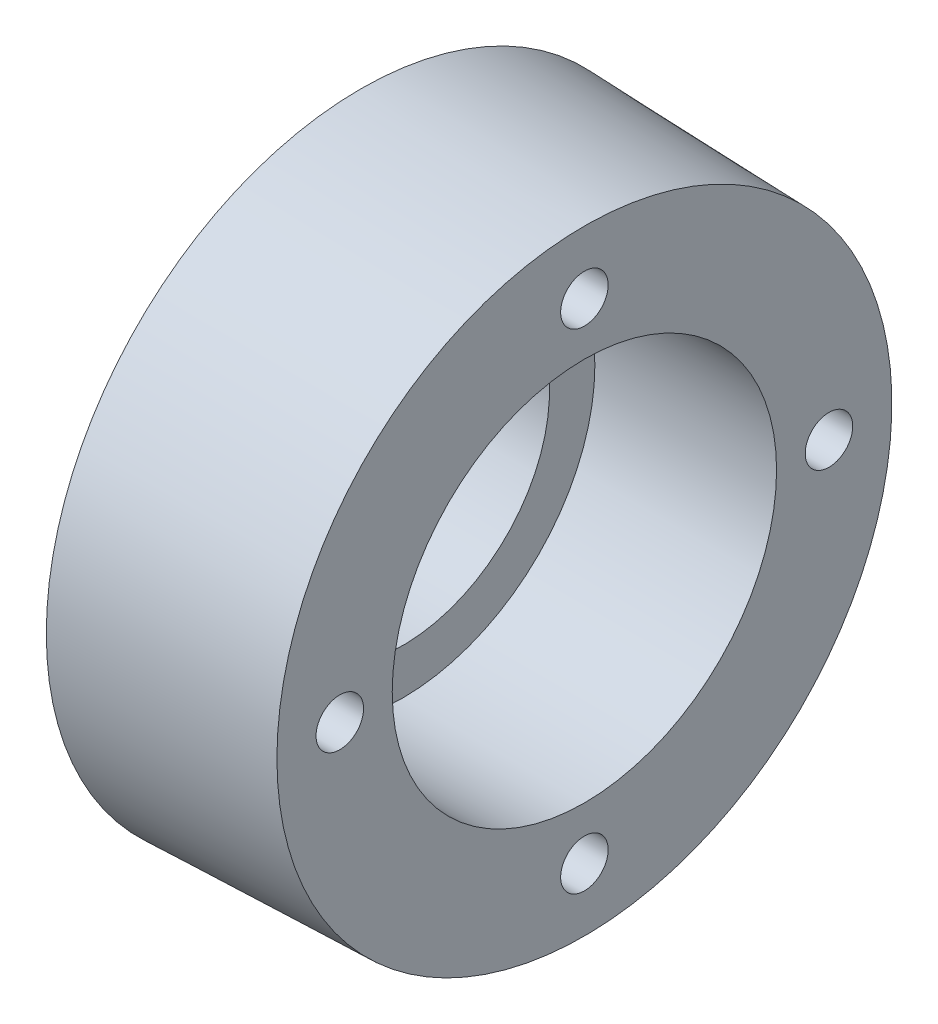
ISO-10303-21;
HEADER;
FILE_DESCRIPTION(('STEP AP214'),'2;1');
FILE_NAME('part.step','',(''),(''),'','','');
FILE_SCHEMA(('AUTOMOTIVE_DESIGN { 1 0 10303 214 1 1 1 1 }'));
ENDSEC;
DATA;
#1=APPLICATION_CONTEXT('core data for automotive mechanical design processes');
#2=APPLICATION_PROTOCOL_DEFINITION('international standard','automotive_design',2000,#1);
#3=PRODUCT_CONTEXT('',#1,'mechanical');
#4=PRODUCT('Part','Part','',(#3));
#5=PRODUCT_RELATED_PRODUCT_CATEGORY('part','',(#4));
#6=PRODUCT_DEFINITION_FORMATION('','',#4);
#7=PRODUCT_DEFINITION_CONTEXT('part definition',#1,'design');
#8=PRODUCT_DEFINITION('design','',#6,#7);
#9=PRODUCT_DEFINITION_SHAPE('','',#8);
#10=(LENGTH_UNIT() NAMED_UNIT(*) SI_UNIT(.MILLI.,.METRE.));
#11=(NAMED_UNIT(*) PLANE_ANGLE_UNIT() SI_UNIT($,.RADIAN.));
#12=(NAMED_UNIT(*) SI_UNIT($,.STERADIAN.) SOLID_ANGLE_UNIT());
#13=UNCERTAINTY_MEASURE_WITH_UNIT(LENGTH_MEASURE(1.E-05),#10,'distance_accuracy_value','');
#14=(GEOMETRIC_REPRESENTATION_CONTEXT(3) GLOBAL_UNCERTAINTY_ASSIGNED_CONTEXT((#13)) GLOBAL_UNIT_ASSIGNED_CONTEXT((#10,
#11,#12)) REPRESENTATION_CONTEXT('',''));
#15=CARTESIAN_POINT('',(0.,0.,0.));
#16=DIRECTION('',(0.,0.,1.));
#17=DIRECTION('',(1.,0.,0.));
#18=AXIS2_PLACEMENT_3D('',#15,#16,#17);
#19=CARTESIAN_POINT('',(0.,21.,0.));
#20=DIRECTION('',(1.,0.,0.));
#21=DIRECTION('',(0.,0.,-1.));
#22=AXIS2_PLACEMENT_3D('',#19,#20,#21);
#23=PLANE('',#22);
#24=CARTESIAN_POINT('',(0.,0.,0.));
#25=DIRECTION('',(-1.,0.,0.));
#26=DIRECTION('',(0.,0.,1.));
#27=AXIS2_PLACEMENT_3D('',#24,#25,#26);
#28=CIRCLE('',#27,21.);
#29=CARTESIAN_POINT('',(0.,0.,21.));
#30=VERTEX_POINT('',#29);
#31=EDGE_CURVE('E93',#30,#30,#28,.T.);
#32=ORIENTED_EDGE('',*,*,#31,.F.);
#33=EDGE_LOOP('',(#32));
#34=FACE_BOUND('',#33,.T.);
#35=CARTESIAN_POINT('',(0.,0.,0.));
#36=DIRECTION('',(-1.,0.,0.));
#37=DIRECTION('',(0.,0.,1.));
#38=AXIS2_PLACEMENT_3D('',#35,#36,#37);
#39=CIRCLE('',#38,28.);
#40=CARTESIAN_POINT('',(0.,0.,28.));
#41=VERTEX_POINT('',#40);
#42=EDGE_CURVE('E11',#41,#41,#39,.T.);
#43=ORIENTED_EDGE('',*,*,#42,.T.);
#44=EDGE_LOOP('',(#43));
#45=FACE_BOUND('',#44,.T.);
#46=ADVANCED_FACE('F40',(#34,#45),#23,.F.);
#47=CARTESIAN_POINT('',(0.,0.,0.));
#48=DIRECTION('',(-1.,0.,0.));
#49=DIRECTION('',(0.,0.,1.));
#50=AXIS2_PLACEMENT_3D('',#47,#48,#49);
#51=CYLINDRICAL_SURFACE('',#50,28.);
#52=ORIENTED_EDGE('',*,*,#42,.F.);
#53=EDGE_LOOP('',(#52));
#54=FACE_BOUND('',#53,.T.);
#55=CARTESIAN_POINT('',(5.,0.,0.));
#56=DIRECTION('',(-1.,0.,0.));
#57=DIRECTION('',(0.,0.,1.));
#58=AXIS2_PLACEMENT_3D('',#55,#56,#57);
#59=CIRCLE('',#58,28.);
#60=CARTESIAN_POINT('',(5.,0.,28.));
#61=VERTEX_POINT('',#60);
#62=EDGE_CURVE('E47',#61,#61,#59,.T.);
#63=ORIENTED_EDGE('',*,*,#62,.T.);
#64=EDGE_LOOP('',(#63));
#65=FACE_BOUND('',#64,.T.);
#66=ADVANCED_FACE('F113',(#54,#65),#51,.T.);
#67=CARTESIAN_POINT('',(5.,28.,0.));
#68=DIRECTION('',(1.,0.,0.));
#69=DIRECTION('',(0.,0.,-1.));
#70=AXIS2_PLACEMENT_3D('',#67,#68,#69);
#71=PLANE('',#70);
#72=ORIENTED_EDGE('',*,*,#62,.F.);
#73=EDGE_LOOP('',(#72));
#74=FACE_BOUND('',#73,.T.);
#75=CARTESIAN_POINT('',(5.,0.,0.));
#76=DIRECTION('',(-1.,0.,0.));
#77=DIRECTION('',(0.,0.,1.));
#78=AXIS2_PLACEMENT_3D('',#75,#76,#77);
#79=CIRCLE('',#78,45.);
#80=CARTESIAN_POINT('',(5.,0.,45.));
#81=VERTEX_POINT('',#80);
#82=EDGE_CURVE('E108',#81,#81,#79,.T.);
#83=ORIENTED_EDGE('',*,*,#82,.T.);
#84=EDGE_LOOP('',(#83));
#85=FACE_BOUND('',#84,.T.);
#86=ADVANCED_FACE('F115',(#74,#85),#71,.F.);
#87=CARTESIAN_POINT('',(37.,0.,0.));
#88=DIRECTION('',(-1.,0.,0.));
#89=DIRECTION('',(0.,0.,1.));
#90=AXIS2_PLACEMENT_3D('',#87,#88,#89);
#91=CONICAL_SURFACE('',#90,44.,0.0312398334302683);
#92=ORIENTED_EDGE('',*,*,#82,.F.);
#93=EDGE_LOOP('',(#92));
#94=FACE_BOUND('',#93,.T.);
#95=CARTESIAN_POINT('',(37.,0.,0.));
#96=DIRECTION('',(-1.,0.,0.));
#97=DIRECTION('',(0.,0.,1.));
#98=AXIS2_PLACEMENT_3D('',#95,#96,#97);
#99=CIRCLE('',#98,44.);
#100=CARTESIAN_POINT('',(37.,0.,44.));
#101=VERTEX_POINT('',#100);
#102=EDGE_CURVE('E105',#101,#101,#99,.T.);
#103=ORIENTED_EDGE('',*,*,#102,.T.);
#104=EDGE_LOOP('',(#103));
#105=FACE_BOUND('',#104,.T.);
#106=ADVANCED_FACE('F118',(#94,#105),#91,.T.);
#107=CARTESIAN_POINT('',(37.,44.,0.));
#108=DIRECTION('',(-1.,0.,0.));
#109=DIRECTION('',(0.,0.,1.));
#110=AXIS2_PLACEMENT_3D('',#107,#108,#109);
#111=PLANE('',#110);
#112=CARTESIAN_POINT('',(37.,3.66605540578529E-13,35.));
#113=DIRECTION('',(1.,0.,0.));
#114=DIRECTION('',(0.,0.,-1.));
#115=AXIS2_PLACEMENT_3D('',#112,#113,#114);
#116=CIRCLE('',#115,3.39999999999999);
#117=CARTESIAN_POINT('',(37.,3.66605540578529E-13,31.6));
#118=VERTEX_POINT('',#117);
#119=EDGE_CURVE('E71',#118,#118,#116,.T.);
#120=ORIENTED_EDGE('',*,*,#119,.F.);
#121=EDGE_LOOP('',(#120));
#122=FACE_BOUND('',#121,.T.);
#123=CARTESIAN_POINT('',(37.,-35.,0.));
#124=DIRECTION('',(1.,0.,0.));
#125=DIRECTION('',(0.,0.,-1.));
#126=AXIS2_PLACEMENT_3D('',#123,#124,#125);
#127=CIRCLE('',#126,3.39999999999999);
#128=CARTESIAN_POINT('',(37.,-35.,-3.39999999999999));
#129=VERTEX_POINT('',#128);
#130=EDGE_CURVE('E70',#129,#129,#127,.T.);
#131=ORIENTED_EDGE('',*,*,#130,.F.);
#132=EDGE_LOOP('',(#131));
#133=FACE_BOUND('',#132,.T.);
#134=CARTESIAN_POINT('',(37.,-1.2220184685951E-13,-35.));
#135=DIRECTION('',(1.,0.,0.));
#136=DIRECTION('',(0.,0.,-1.));
#137=AXIS2_PLACEMENT_3D('',#134,#135,#136);
#138=CIRCLE('',#137,3.39999999999999);
#139=CARTESIAN_POINT('',(37.,-1.2220184685951E-13,-38.4));
#140=VERTEX_POINT('',#139);
#141=EDGE_CURVE('E81',#140,#140,#138,.T.);
#142=ORIENTED_EDGE('',*,*,#141,.F.);
#143=EDGE_LOOP('',(#142));
#144=FACE_BOUND('',#143,.T.);
#145=CARTESIAN_POINT('',(37.,35.,0.));
#146=DIRECTION('',(1.,0.,0.));
#147=DIRECTION('',(0.,0.,-1.));
#148=AXIS2_PLACEMENT_3D('',#145,#146,#147);
#149=CIRCLE('',#148,3.39999999999999);
#150=CARTESIAN_POINT('',(37.,35.,-3.39999999999999));
#151=VERTEX_POINT('',#150);
#152=EDGE_CURVE('E87',#151,#151,#149,.T.);
#153=ORIENTED_EDGE('',*,*,#152,.F.);
#154=EDGE_LOOP('',(#153));
#155=FACE_BOUND('',#154,.T.);
#156=ORIENTED_EDGE('',*,*,#102,.F.);
#157=EDGE_LOOP('',(#156));
#158=FACE_BOUND('',#157,.T.);
#159=CARTESIAN_POINT('',(37.,0.,0.));
#160=DIRECTION('',(-1.,0.,0.));
#161=DIRECTION('',(0.,0.,1.));
#162=AXIS2_PLACEMENT_3D('',#159,#160,#161);
#163=CIRCLE('',#162,27.5);
#164=CARTESIAN_POINT('',(37.,0.,27.5));
#165=VERTEX_POINT('',#164);
#166=EDGE_CURVE('E102',#165,#165,#163,.T.);
#167=ORIENTED_EDGE('',*,*,#166,.T.);
#168=EDGE_LOOP('',(#167));
#169=FACE_BOUND('',#168,.T.);
#170=ADVANCED_FACE('F124',(#122,#133,#144,#155,#158,#169),#111,.F.);
#171=CARTESIAN_POINT('',(0.,0.,0.));
#172=DIRECTION('',(-1.,0.,0.));
#173=DIRECTION('',(0.,0.,1.));
#174=AXIS2_PLACEMENT_3D('',#171,#172,#173);
#175=CYLINDRICAL_SURFACE('',#174,27.5);
#176=ORIENTED_EDGE('',*,*,#166,.F.);
#177=EDGE_LOOP('',(#176));
#178=FACE_BOUND('',#177,.T.);
#179=CARTESIAN_POINT('',(11.,0.,0.));
#180=DIRECTION('',(-1.,0.,0.));
#181=DIRECTION('',(0.,0.,1.));
#182=AXIS2_PLACEMENT_3D('',#179,#180,#181);
#183=CIRCLE('',#182,27.5);
#184=CARTESIAN_POINT('',(11.,0.,27.5));
#185=VERTEX_POINT('',#184);
#186=EDGE_CURVE('E99',#185,#185,#183,.T.);
#187=ORIENTED_EDGE('',*,*,#186,.T.);
#188=EDGE_LOOP('',(#187));
#189=FACE_BOUND('',#188,.T.);
#190=ADVANCED_FACE('F130',(#178,#189),#175,.F.);
#191=CARTESIAN_POINT('',(11.,21.,0.));
#192=DIRECTION('',(-1.,0.,0.));
#193=DIRECTION('',(0.,0.,1.));
#194=AXIS2_PLACEMENT_3D('',#191,#192,#193);
#195=PLANE('',#194);
#196=ORIENTED_EDGE('',*,*,#186,.F.);
#197=EDGE_LOOP('',(#196));
#198=FACE_BOUND('',#197,.T.);
#199=CARTESIAN_POINT('',(11.,0.,0.));
#200=DIRECTION('',(-1.,0.,0.));
#201=DIRECTION('',(0.,0.,1.));
#202=AXIS2_PLACEMENT_3D('',#199,#200,#201);
#203=CIRCLE('',#202,21.);
#204=CARTESIAN_POINT('',(11.,0.,21.));
#205=VERTEX_POINT('',#204);
#206=EDGE_CURVE('E96',#205,#205,#203,.T.);
#207=ORIENTED_EDGE('',*,*,#206,.T.);
#208=EDGE_LOOP('',(#207));
#209=FACE_BOUND('',#208,.T.);
#210=ADVANCED_FACE('F137',(#198,#209),#195,.F.);
#211=CARTESIAN_POINT('',(0.,0.,0.));
#212=DIRECTION('',(-1.,0.,0.));
#213=DIRECTION('',(0.,0.,1.));
#214=AXIS2_PLACEMENT_3D('',#211,#212,#213);
#215=CYLINDRICAL_SURFACE('',#214,21.);
#216=ORIENTED_EDGE('',*,*,#206,.F.);
#217=EDGE_LOOP('',(#216));
#218=FACE_BOUND('',#217,.T.);
#219=ORIENTED_EDGE('',*,*,#31,.T.);
#220=EDGE_LOOP('',(#219));
#221=FACE_BOUND('',#220,.T.);
#222=ADVANCED_FACE('F143',(#218,#221),#215,.F.);
#223=CARTESIAN_POINT('',(14.75,35.,0.));
#224=DIRECTION('',(1.,0.,0.));
#225=DIRECTION('',(0.,0.,-1.));
#226=AXIS2_PLACEMENT_3D('',#223,#224,#225);
#227=CONICAL_SURFACE('',#226,3.39999999999999,1.02974425867665);
#228=CARTESIAN_POINT('',(12.7070738953063,35.,0.));
#229=VERTEX_POINT('',#228);
#230=VERTEX_LOOP('',#229);
#231=FACE_BOUND('',#230,.T.);
#232=CARTESIAN_POINT('',(14.75,35.,0.));
#233=DIRECTION('',(1.,0.,0.));
#234=DIRECTION('',(0.,0.,-1.));
#235=AXIS2_PLACEMENT_3D('',#232,#233,#234);
#236=CIRCLE('',#235,3.39999999999999);
#237=CARTESIAN_POINT('',(14.75,35.,-3.39999999999999));
#238=VERTEX_POINT('',#237);
#239=EDGE_CURVE('E90',#238,#238,#236,.T.);
#240=ORIENTED_EDGE('',*,*,#239,.T.);
#241=EDGE_LOOP('',(#240));
#242=FACE_BOUND('',#241,.T.);
#243=ADVANCED_FACE('F149',(#231,#242),#227,.F.);
#244=CARTESIAN_POINT('',(37.,35.,0.));
#245=DIRECTION('',(1.,0.,0.));
#246=DIRECTION('',(0.,0.,-1.));
#247=AXIS2_PLACEMENT_3D('',#244,#245,#246);
#248=CYLINDRICAL_SURFACE('',#247,3.39999999999999);
#249=ORIENTED_EDGE('',*,*,#239,.F.);
#250=EDGE_LOOP('',(#249));
#251=FACE_BOUND('',#250,.T.);
#252=ORIENTED_EDGE('',*,*,#152,.T.);
#253=EDGE_LOOP('',(#252));
#254=FACE_BOUND('',#253,.T.);
#255=ADVANCED_FACE('F163',(#251,#254),#248,.F.);
#256=CARTESIAN_POINT('',(14.75,-1.2220184685951E-13,-35.));
#257=DIRECTION('',(1.,0.,0.));
#258=DIRECTION('',(0.,0.,-1.));
#259=AXIS2_PLACEMENT_3D('',#256,#257,#258);
#260=CONICAL_SURFACE('',#259,3.39999999999999,1.02974425867665);
#261=CARTESIAN_POINT('',(12.7070738953063,-1.28151897698717E-13,-35.));
#262=VERTEX_POINT('',#261);
#263=VERTEX_LOOP('',#262);
#264=FACE_BOUND('',#263,.T.);
#265=CARTESIAN_POINT('',(14.75,-1.2220184685951E-13,-35.));
#266=DIRECTION('',(1.,0.,0.));
#267=DIRECTION('',(0.,0.,-1.));
#268=AXIS2_PLACEMENT_3D('',#265,#266,#267);
#269=CIRCLE('',#268,3.39999999999999);
#270=CARTESIAN_POINT('',(14.75,-1.2220184685951E-13,-38.4));
#271=VERTEX_POINT('',#270);
#272=EDGE_CURVE('E84',#271,#271,#269,.T.);
#273=ORIENTED_EDGE('',*,*,#272,.T.);
#274=EDGE_LOOP('',(#273));
#275=FACE_BOUND('',#274,.T.);
#276=ADVANCED_FACE('F166',(#264,#275),#260,.F.);
#277=CARTESIAN_POINT('',(37.,-1.2220184685951E-13,-35.));
#278=DIRECTION('',(1.,0.,0.));
#279=DIRECTION('',(0.,0.,-1.));
#280=AXIS2_PLACEMENT_3D('',#277,#278,#279);
#281=CYLINDRICAL_SURFACE('',#280,3.39999999999999);
#282=ORIENTED_EDGE('',*,*,#272,.F.);
#283=EDGE_LOOP('',(#282));
#284=FACE_BOUND('',#283,.T.);
#285=ORIENTED_EDGE('',*,*,#141,.T.);
#286=EDGE_LOOP('',(#285));
#287=FACE_BOUND('',#286,.T.);
#288=ADVANCED_FACE('F170',(#284,#287),#281,.F.);
#289=CARTESIAN_POINT('',(14.75,-35.,0.));
#290=DIRECTION('',(1.,0.,0.));
#291=DIRECTION('',(0.,0.,-1.));
#292=AXIS2_PLACEMENT_3D('',#289,#290,#291);
#293=CONICAL_SURFACE('',#292,3.39999999999999,1.02974425867665);
#294=CARTESIAN_POINT('',(12.7070738953063,-35.,0.));
#295=VERTEX_POINT('',#294);
#296=VERTEX_LOOP('',#295);
#297=FACE_BOUND('',#296,.T.);
#298=CARTESIAN_POINT('',(14.75,-35.,0.));
#299=DIRECTION('',(1.,0.,0.));
#300=DIRECTION('',(0.,0.,-1.));
#301=AXIS2_PLACEMENT_3D('',#298,#299,#300);
#302=CIRCLE('',#301,3.39999999999999);
#303=CARTESIAN_POINT('',(14.75,-35.,-3.39999999999999));
#304=VERTEX_POINT('',#303);
#305=EDGE_CURVE('E74',#304,#304,#302,.T.);
#306=ORIENTED_EDGE('',*,*,#305,.T.);
#307=EDGE_LOOP('',(#306));
#308=FACE_BOUND('',#307,.T.);
#309=ADVANCED_FACE('F173',(#297,#308),#293,.F.);
#310=CARTESIAN_POINT('',(37.,-35.,0.));
#311=DIRECTION('',(1.,0.,0.));
#312=DIRECTION('',(0.,0.,-1.));
#313=AXIS2_PLACEMENT_3D('',#310,#311,#312);
#314=CYLINDRICAL_SURFACE('',#313,3.39999999999999);
#315=ORIENTED_EDGE('',*,*,#305,.F.);
#316=EDGE_LOOP('',(#315));
#317=FACE_BOUND('',#316,.T.);
#318=ORIENTED_EDGE('',*,*,#130,.T.);
#319=EDGE_LOOP('',(#318));
#320=FACE_BOUND('',#319,.T.);
#321=ADVANCED_FACE('F64',(#317,#320),#314,.F.);
#322=CARTESIAN_POINT('',(14.75,3.66605540578529E-13,35.));
#323=DIRECTION('',(1.,0.,0.));
#324=DIRECTION('',(0.,0.,-1.));
#325=AXIS2_PLACEMENT_3D('',#322,#323,#324);
#326=CONICAL_SURFACE('',#325,3.39999999999999,1.02974425867665);
#327=CARTESIAN_POINT('',(12.7070738953063,3.60655489739322E-13,35.));
#328=VERTEX_POINT('',#327);
#329=VERTEX_LOOP('',#328);
#330=FACE_BOUND('',#329,.T.);
#331=CARTESIAN_POINT('',(14.75,3.66605540578529E-13,35.));
#332=DIRECTION('',(1.,0.,0.));
#333=DIRECTION('',(0.,0.,-1.));
#334=AXIS2_PLACEMENT_3D('',#331,#332,#333);
#335=CIRCLE('',#334,3.39999999999999);
#336=CARTESIAN_POINT('',(14.75,3.66605540578529E-13,31.6));
#337=VERTEX_POINT('',#336);
#338=EDGE_CURVE('E68',#337,#337,#335,.T.);
#339=ORIENTED_EDGE('',*,*,#338,.T.);
#340=EDGE_LOOP('',(#339));
#341=FACE_BOUND('',#340,.T.);
#342=ADVANCED_FACE('F60',(#330,#341),#326,.F.);
#343=CARTESIAN_POINT('',(37.,3.66605540578529E-13,35.));
#344=DIRECTION('',(1.,0.,0.));
#345=DIRECTION('',(0.,0.,-1.));
#346=AXIS2_PLACEMENT_3D('',#343,#344,#345);
#347=CYLINDRICAL_SURFACE('',#346,3.39999999999999);
#348=ORIENTED_EDGE('',*,*,#338,.F.);
#349=EDGE_LOOP('',(#348));
#350=FACE_BOUND('',#349,.T.);
#351=ORIENTED_EDGE('',*,*,#119,.T.);
#352=EDGE_LOOP('',(#351));
#353=FACE_BOUND('',#352,.T.);
#354=ADVANCED_FACE('F63',(#350,#353),#347,.F.);
#355=CLOSED_SHELL('',(#46,#66,#86,#106,#170,#190,#210,#222,#243,#255,#276,#288,#309,#321,#342,#354));
#356=MANIFOLD_SOLID_BREP('B2',#355);
#357=ADVANCED_BREP_SHAPE_REPRESENTATION('',(#18,#356),#14);
#358=SHAPE_DEFINITION_REPRESENTATION(#9,#357);
ENDSEC;
END-ISO-10303-21;
